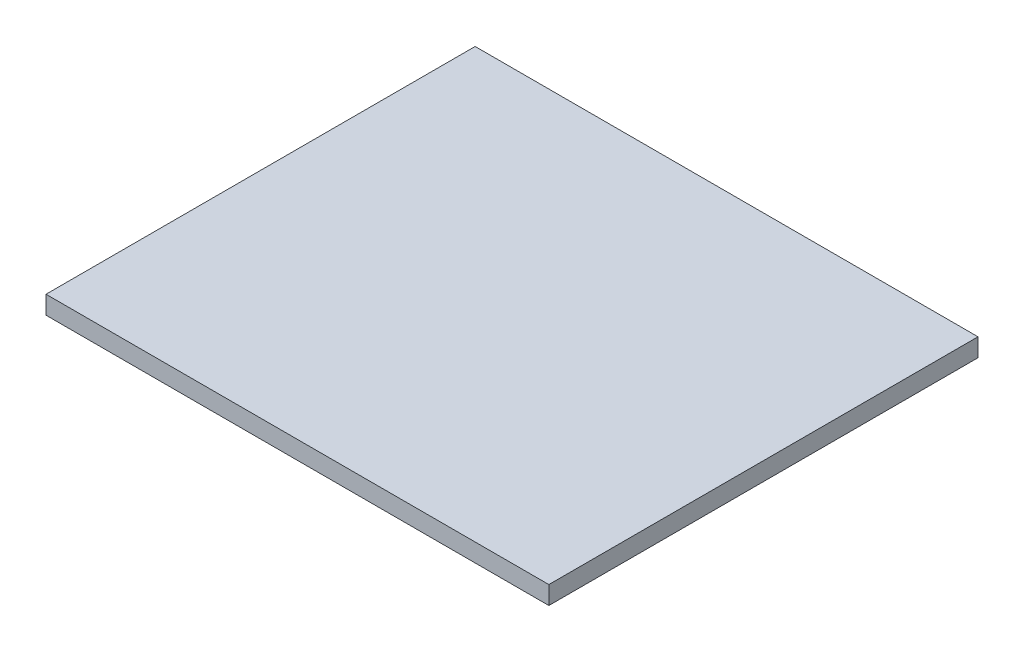
ISO-10303-21;
HEADER;
FILE_DESCRIPTION(('STEP AP214'),'2;1');
FILE_NAME('part.step','',(''),(''),'','','');
FILE_SCHEMA(('AUTOMOTIVE_DESIGN { 1 0 10303 214 1 1 1 1 }'));
ENDSEC;
DATA;
#1=APPLICATION_CONTEXT('core data for automotive mechanical design processes');
#2=APPLICATION_PROTOCOL_DEFINITION('international standard','automotive_design',2000,#1);
#3=PRODUCT_CONTEXT('',#1,'mechanical');
#4=PRODUCT('Part','Part','',(#3));
#5=PRODUCT_RELATED_PRODUCT_CATEGORY('part','',(#4));
#6=PRODUCT_DEFINITION_FORMATION('','',#4);
#7=PRODUCT_DEFINITION_CONTEXT('part definition',#1,'design');
#8=PRODUCT_DEFINITION('design','',#6,#7);
#9=PRODUCT_DEFINITION_SHAPE('','',#8);
#10=(LENGTH_UNIT() NAMED_UNIT(*) SI_UNIT(.MILLI.,.METRE.));
#11=(NAMED_UNIT(*) PLANE_ANGLE_UNIT() SI_UNIT($,.RADIAN.));
#12=(NAMED_UNIT(*) SI_UNIT($,.STERADIAN.) SOLID_ANGLE_UNIT());
#13=UNCERTAINTY_MEASURE_WITH_UNIT(LENGTH_MEASURE(1.E-05),#10,'distance_accuracy_value','');
#14=(GEOMETRIC_REPRESENTATION_CONTEXT(3) GLOBAL_UNCERTAINTY_ASSIGNED_CONTEXT((#13)) GLOBAL_UNIT_ASSIGNED_CONTEXT((#10,
#11,#12)) REPRESENTATION_CONTEXT('',''));
#15=CARTESIAN_POINT('',(0.,0.,0.));
#16=DIRECTION('',(0.,0.,1.));
#17=DIRECTION('',(1.,0.,0.));
#18=AXIS2_PLACEMENT_3D('',#15,#16,#17);
#19=CARTESIAN_POINT('',(-249.,18.,212.5));
#20=DIRECTION('',(1.,0.,0.));
#21=DIRECTION('',(0.,0.,-1.));
#22=AXIS2_PLACEMENT_3D('',#19,#20,#21);
#23=PLANE('',#22);
#24=DIRECTION('',(0.,0.,1.));
#25=VECTOR('',#24,1.);
#26=CARTESIAN_POINT('',(-249.,0.,212.5));
#27=LINE('',#26,#25);
#28=CARTESIAN_POINT('',(-249.,0.,-212.5));
#29=VERTEX_POINT('',#28);
#30=CARTESIAN_POINT('',(-249.,0.,212.5));
#31=VERTEX_POINT('',#30);
#32=EDGE_CURVE('E98',#29,#31,#27,.T.);
#33=ORIENTED_EDGE('',*,*,#32,.T.);
#34=DIRECTION('',(0.,-1.,0.));
#35=VECTOR('',#34,1.);
#36=CARTESIAN_POINT('',(-249.,18.,212.5));
#37=LINE('',#36,#35);
#38=CARTESIAN_POINT('',(-249.,18.,212.5));
#39=VERTEX_POINT('',#38);
#40=EDGE_CURVE('E11',#39,#31,#37,.T.);
#41=ORIENTED_EDGE('',*,*,#40,.F.);
#42=DIRECTION('',(0.,0.,1.));
#43=VECTOR('',#42,1.);
#44=CARTESIAN_POINT('',(-249.,18.,212.5));
#45=LINE('',#44,#43);
#46=CARTESIAN_POINT('',(-249.,18.,-212.5));
#47=VERTEX_POINT('',#46);
#48=EDGE_CURVE('E86',#47,#39,#45,.T.);
#49=ORIENTED_EDGE('',*,*,#48,.F.);
#50=DIRECTION('',(0.,-1.,0.));
#51=VECTOR('',#50,1.);
#52=CARTESIAN_POINT('',(-249.,18.,-212.5));
#53=LINE('',#52,#51);
#54=EDGE_CURVE('E94',#47,#29,#53,.T.);
#55=ORIENTED_EDGE('',*,*,#54,.T.);
#56=EDGE_LOOP('',(#33,#41,#49,#55));
#57=FACE_BOUND('',#56,.T.);
#58=ADVANCED_FACE('F35',(#57),#23,.F.);
#59=CARTESIAN_POINT('',(249.,18.,212.5));
#60=DIRECTION('',(0.,0.,-1.));
#61=DIRECTION('',(-1.,0.,0.));
#62=AXIS2_PLACEMENT_3D('',#59,#60,#61);
#63=PLANE('',#62);
#64=DIRECTION('',(1.,0.,0.));
#65=VECTOR('',#64,1.);
#66=CARTESIAN_POINT('',(249.,0.,212.5));
#67=LINE('',#66,#65);
#68=CARTESIAN_POINT('',(249.,0.,212.5));
#69=VERTEX_POINT('',#68);
#70=EDGE_CURVE('E90',#31,#69,#67,.T.);
#71=ORIENTED_EDGE('',*,*,#70,.T.);
#72=DIRECTION('',(0.,-1.,0.));
#73=VECTOR('',#72,1.);
#74=CARTESIAN_POINT('',(249.,18.,212.5));
#75=LINE('',#74,#73);
#76=CARTESIAN_POINT('',(249.,18.,212.5));
#77=VERTEX_POINT('',#76);
#78=EDGE_CURVE('E43',#77,#69,#75,.T.);
#79=ORIENTED_EDGE('',*,*,#78,.F.);
#80=DIRECTION('',(1.,0.,0.));
#81=VECTOR('',#80,1.);
#82=CARTESIAN_POINT('',(249.,18.,212.5));
#83=LINE('',#82,#81);
#84=EDGE_CURVE('E81',#39,#77,#83,.T.);
#85=ORIENTED_EDGE('',*,*,#84,.F.);
#86=ORIENTED_EDGE('',*,*,#40,.T.);
#87=EDGE_LOOP('',(#71,#79,#85,#86));
#88=FACE_BOUND('',#87,.T.);
#89=ADVANCED_FACE('F89',(#88),#63,.F.);
#90=CARTESIAN_POINT('',(249.,18.,212.5));
#91=DIRECTION('',(-1.,0.,0.));
#92=DIRECTION('',(0.,0.,1.));
#93=AXIS2_PLACEMENT_3D('',#90,#91,#92);
#94=PLANE('',#93);
#95=DIRECTION('',(0.,0.,-1.));
#96=VECTOR('',#95,1.);
#97=CARTESIAN_POINT('',(249.,0.,212.5));
#98=LINE('',#97,#96);
#99=CARTESIAN_POINT('',(249.,0.,-212.5));
#100=VERTEX_POINT('',#99);
#101=EDGE_CURVE('E68',#69,#100,#98,.T.);
#102=ORIENTED_EDGE('',*,*,#101,.T.);
#103=DIRECTION('',(0.,-1.,0.));
#104=VECTOR('',#103,1.);
#105=CARTESIAN_POINT('',(249.,18.,-212.5));
#106=LINE('',#105,#104);
#107=CARTESIAN_POINT('',(249.,18.,-212.5));
#108=VERTEX_POINT('',#107);
#109=EDGE_CURVE('E91',#108,#100,#106,.T.);
#110=ORIENTED_EDGE('',*,*,#109,.F.);
#111=DIRECTION('',(0.,0.,-1.));
#112=VECTOR('',#111,1.);
#113=CARTESIAN_POINT('',(249.,18.,212.5));
#114=LINE('',#113,#112);
#115=EDGE_CURVE('E84',#77,#108,#114,.T.);
#116=ORIENTED_EDGE('',*,*,#115,.F.);
#117=ORIENTED_EDGE('',*,*,#78,.T.);
#118=EDGE_LOOP('',(#102,#110,#116,#117));
#119=FACE_BOUND('',#118,.T.);
#120=ADVANCED_FACE('F92',(#119),#94,.F.);
#121=CARTESIAN_POINT('',(249.,18.,-212.5));
#122=DIRECTION('',(0.,0.,1.));
#123=DIRECTION('',(1.,0.,0.));
#124=AXIS2_PLACEMENT_3D('',#121,#122,#123);
#125=PLANE('',#124);
#126=DIRECTION('',(-1.,0.,0.));
#127=VECTOR('',#126,1.);
#128=CARTESIAN_POINT('',(249.,0.,-212.5));
#129=LINE('',#128,#127);
#130=EDGE_CURVE('E74',#100,#29,#129,.T.);
#131=ORIENTED_EDGE('',*,*,#130,.T.);
#132=ORIENTED_EDGE('',*,*,#54,.F.);
#133=DIRECTION('',(-1.,0.,0.));
#134=VECTOR('',#133,1.);
#135=CARTESIAN_POINT('',(249.,18.,-212.5));
#136=LINE('',#135,#134);
#137=EDGE_CURVE('E51',#108,#47,#136,.T.);
#138=ORIENTED_EDGE('',*,*,#137,.F.);
#139=ORIENTED_EDGE('',*,*,#109,.T.);
#140=EDGE_LOOP('',(#131,#132,#138,#139));
#141=FACE_BOUND('',#140,.T.);
#142=ADVANCED_FACE('F105',(#141),#125,.F.);
#143=CARTESIAN_POINT('',(0.,18.,0.));
#144=DIRECTION('',(0.,1.,0.));
#145=DIRECTION('',(0.,0.,1.));
#146=AXIS2_PLACEMENT_3D('',#143,#144,#145);
#147=PLANE('',#146);
#148=ORIENTED_EDGE('',*,*,#48,.T.);
#149=ORIENTED_EDGE('',*,*,#84,.T.);
#150=ORIENTED_EDGE('',*,*,#115,.T.);
#151=ORIENTED_EDGE('',*,*,#137,.T.);
#152=EDGE_LOOP('',(#148,#149,#150,#151));
#153=FACE_BOUND('',#152,.T.);
#154=ADVANCED_FACE('F82',(#153),#147,.T.);
#155=CARTESIAN_POINT('',(0.,0.,0.));
#156=DIRECTION('',(0.,1.,0.));
#157=DIRECTION('',(0.,0.,1.));
#158=AXIS2_PLACEMENT_3D('',#155,#156,#157);
#159=PLANE('',#158);
#160=ORIENTED_EDGE('',*,*,#32,.F.);
#161=ORIENTED_EDGE('',*,*,#130,.F.);
#162=ORIENTED_EDGE('',*,*,#101,.F.);
#163=ORIENTED_EDGE('',*,*,#70,.F.);
#164=EDGE_LOOP('',(#160,#161,#162,#163));
#165=FACE_BOUND('',#164,.T.);
#166=ADVANCED_FACE('F108',(#165),#159,.F.);
#167=CLOSED_SHELL('',(#58,#89,#120,#142,#154,#166));
#168=MANIFOLD_SOLID_BREP('B2',#167);
#169=ADVANCED_BREP_SHAPE_REPRESENTATION('',(#18,#168),#14);
#170=SHAPE_DEFINITION_REPRESENTATION(#9,#169);
ENDSEC;
END-ISO-10303-21;
